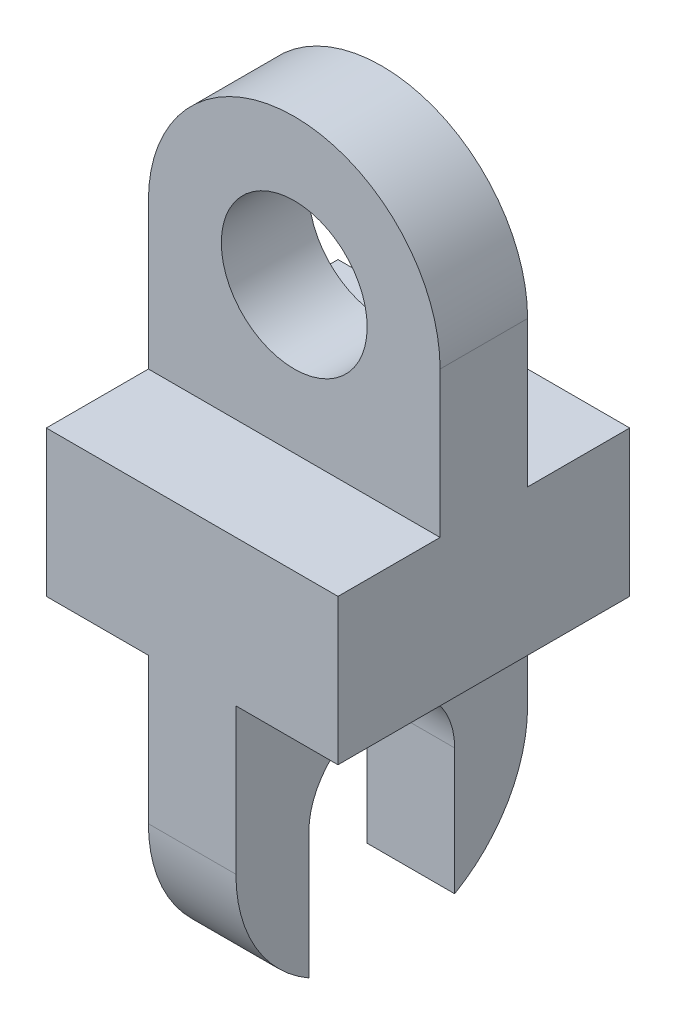
ISO-10303-21;
HEADER;
FILE_DESCRIPTION(('STEP AP214'),'2;1');
FILE_NAME('part.step','',(''),(''),'','','');
FILE_SCHEMA(('AUTOMOTIVE_DESIGN { 1 0 10303 214 1 1 1 1 }'));
ENDSEC;
DATA;
#1=APPLICATION_CONTEXT('core data for automotive mechanical design processes');
#2=APPLICATION_PROTOCOL_DEFINITION('international standard','automotive_design',2000,#1);
#3=PRODUCT_CONTEXT('',#1,'mechanical');
#4=PRODUCT('Part','Part','',(#3));
#5=PRODUCT_RELATED_PRODUCT_CATEGORY('part','',(#4));
#6=PRODUCT_DEFINITION_FORMATION('','',#4);
#7=PRODUCT_DEFINITION_CONTEXT('part definition',#1,'design');
#8=PRODUCT_DEFINITION('design','',#6,#7);
#9=PRODUCT_DEFINITION_SHAPE('','',#8);
#10=(LENGTH_UNIT() NAMED_UNIT(*) SI_UNIT(.MILLI.,.METRE.));
#11=(NAMED_UNIT(*) PLANE_ANGLE_UNIT() SI_UNIT($,.RADIAN.));
#12=(NAMED_UNIT(*) SI_UNIT($,.STERADIAN.) SOLID_ANGLE_UNIT());
#13=UNCERTAINTY_MEASURE_WITH_UNIT(LENGTH_MEASURE(1.E-05),#10,'distance_accuracy_value','');
#14=(GEOMETRIC_REPRESENTATION_CONTEXT(3) GLOBAL_UNCERTAINTY_ASSIGNED_CONTEXT((#13)) GLOBAL_UNIT_ASSIGNED_CONTEXT((#10,
#11,#12)) REPRESENTATION_CONTEXT('',''));
#15=CARTESIAN_POINT('',(0.,0.,0.));
#16=DIRECTION('',(0.,0.,1.));
#17=DIRECTION('',(1.,0.,0.));
#18=AXIS2_PLACEMENT_3D('',#15,#16,#17);
#19=CARTESIAN_POINT('',(50.,-50.,50.));
#20=DIRECTION('',(-1.,0.,0.));
#21=DIRECTION('',(0.,-1.,0.));
#22=AXIS2_PLACEMENT_3D('',#19,#20,#21);
#23=CYLINDRICAL_SURFACE('',#22,50.);
#24=DIRECTION('',(-1.,0.,0.));
#25=VECTOR('',#24,1.);
#26=CARTESIAN_POINT('',(50.,-93.301270189222,75.));
#27=LINE('',#26,#25);
#28=CARTESIAN_POINT('',(15.,-93.301270189222,75.));
#29=VERTEX_POINT('',#28);
#30=CARTESIAN_POINT('',(-15.,-93.301270189222,75.));
#31=VERTEX_POINT('',#30);
#32=EDGE_CURVE('E318',#29,#31,#27,.T.);
#33=ORIENTED_EDGE('',*,*,#32,.F.);
#34=CARTESIAN_POINT('',(15.,-50.,50.));
#35=DIRECTION('',(1.,0.,0.));
#36=DIRECTION('',(0.,1.,0.));
#37=AXIS2_PLACEMENT_3D('',#34,#35,#36);
#38=CIRCLE('',#37,50.);
#39=CARTESIAN_POINT('',(15.,-50.,100.));
#40=VERTEX_POINT('',#39);
#41=EDGE_CURVE('E294',#29,#40,#38,.F.);
#42=ORIENTED_EDGE('',*,*,#41,.T.);
#43=DIRECTION('',(-1.,0.,0.));
#44=VECTOR('',#43,1.);
#45=CARTESIAN_POINT('',(50.,-50.,100.));
#46=LINE('',#45,#44);
#47=CARTESIAN_POINT('',(-15.,-50.,100.));
#48=VERTEX_POINT('',#47);
#49=EDGE_CURVE('E191',#40,#48,#46,.T.);
#50=ORIENTED_EDGE('',*,*,#49,.T.);
#51=CARTESIAN_POINT('',(-15.,-50.,50.));
#52=DIRECTION('',(-1.,0.,0.));
#53=DIRECTION('',(0.,-1.,0.));
#54=AXIS2_PLACEMENT_3D('',#51,#52,#53);
#55=CIRCLE('',#54,50.);
#56=EDGE_CURVE('E181',#48,#31,#55,.F.);
#57=ORIENTED_EDGE('',*,*,#56,.T.);
#58=EDGE_LOOP('',(#33,#42,#50,#57));
#59=FACE_BOUND('',#58,.T.);
#60=ADVANCED_FACE('F45',(#59),#23,.T.);
#61=DIRECTION('',(-1.,0.,0.));
#62=VECTOR('',#61,1.);
#63=CARTESIAN_POINT('',(50.,-93.301270189222,25.));
#64=LINE('',#63,#62);
#65=CARTESIAN_POINT('',(-15.,-93.301270189222,25.));
#66=VERTEX_POINT('',#65);
#67=CARTESIAN_POINT('',(15.,-93.301270189222,25.));
#68=VERTEX_POINT('',#67);
#69=EDGE_CURVE('E61',#66,#68,#64,.F.);
#70=ORIENTED_EDGE('',*,*,#69,.F.);
#71=CARTESIAN_POINT('',(-15.,-50.,0.));
#72=VERTEX_POINT('',#71);
#73=EDGE_CURVE('E185',#66,#72,#55,.F.);
#74=ORIENTED_EDGE('',*,*,#73,.T.);
#75=DIRECTION('',(-1.,0.,0.));
#76=VECTOR('',#75,1.);
#77=CARTESIAN_POINT('',(50.,-50.,0.));
#78=LINE('',#77,#76);
#79=CARTESIAN_POINT('',(15.,-50.,0.));
#80=VERTEX_POINT('',#79);
#81=EDGE_CURVE('E265',#80,#72,#78,.T.);
#82=ORIENTED_EDGE('',*,*,#81,.F.);
#83=EDGE_CURVE('E68',#80,#68,#38,.F.);
#84=ORIENTED_EDGE('',*,*,#83,.T.);
#85=EDGE_LOOP('',(#70,#74,#82,#84));
#86=FACE_BOUND('',#85,.T.);
#87=ADVANCED_FACE('F334',(#86),#23,.T.);
#88=CARTESIAN_POINT('',(0.,100.,100.));
#89=DIRECTION('',(0.,0.,-1.));
#90=DIRECTION('',(-1.,0.,0.));
#91=AXIS2_PLACEMENT_3D('',#88,#89,#90);
#92=CYLINDRICAL_SURFACE('',#91,50.);
#93=CARTESIAN_POINT('',(0.,100.,35.));
#94=DIRECTION('',(0.,0.,-1.));
#95=DIRECTION('',(-1.,0.,0.));
#96=AXIS2_PLACEMENT_3D('',#93,#94,#95);
#97=CIRCLE('',#96,50.);
#98=CARTESIAN_POINT('',(-50.,100.,35.));
#99=VERTEX_POINT('',#98);
#100=CARTESIAN_POINT('',(50.,100.,35.));
#101=VERTEX_POINT('',#100);
#102=EDGE_CURVE('E257',#99,#101,#97,.T.);
#103=ORIENTED_EDGE('',*,*,#102,.F.);
#104=DIRECTION('',(0.,0.,-1.));
#105=VECTOR('',#104,1.);
#106=CARTESIAN_POINT('',(-50.,100.,100.));
#107=LINE('',#106,#105);
#108=CARTESIAN_POINT('',(-50.,100.,65.));
#109=VERTEX_POINT('',#108);
#110=EDGE_CURVE('E200',#109,#99,#107,.T.);
#111=ORIENTED_EDGE('',*,*,#110,.F.);
#112=CARTESIAN_POINT('',(0.,100.,65.));
#113=DIRECTION('',(0.,0.,1.));
#114=DIRECTION('',(1.,0.,0.));
#115=AXIS2_PLACEMENT_3D('',#112,#113,#114);
#116=CIRCLE('',#115,50.);
#117=CARTESIAN_POINT('',(50.,100.,65.));
#118=VERTEX_POINT('',#117);
#119=EDGE_CURVE('E232',#118,#109,#116,.T.);
#120=ORIENTED_EDGE('',*,*,#119,.F.);
#121=DIRECTION('',(0.,0.,-1.));
#122=VECTOR('',#121,1.);
#123=CARTESIAN_POINT('',(50.,100.,100.));
#124=LINE('',#123,#122);
#125=EDGE_CURVE('E196',#118,#101,#124,.T.);
#126=ORIENTED_EDGE('',*,*,#125,.T.);
#127=EDGE_LOOP('',(#103,#111,#120,#126));
#128=FACE_BOUND('',#127,.T.);
#129=ADVANCED_FACE('F368',(#128),#92,.T.);
#130=CARTESIAN_POINT('',(50.,100.,100.));
#131=DIRECTION('',(-1.,0.,0.));
#132=DIRECTION('',(0.,-1.,0.));
#133=AXIS2_PLACEMENT_3D('',#130,#131,#132);
#134=PLANE('',#133);
#135=DIRECTION('',(0.,1.,0.));
#136=VECTOR('',#135,1.);
#137=CARTESIAN_POINT('',(50.,100.,100.));
#138=LINE('',#137,#136);
#139=CARTESIAN_POINT('',(50.,0.,100.));
#140=VERTEX_POINT('',#139);
#141=CARTESIAN_POINT('',(50.,50.,100.));
#142=VERTEX_POINT('',#141);
#143=EDGE_CURVE('E209',#140,#142,#138,.T.);
#144=ORIENTED_EDGE('',*,*,#143,.F.);
#145=DIRECTION('',(0.,0.,1.));
#146=VECTOR('',#145,1.);
#147=CARTESIAN_POINT('',(50.,0.,100.));
#148=LINE('',#147,#146);
#149=CARTESIAN_POINT('',(50.,0.,0.));
#150=VERTEX_POINT('',#149);
#151=EDGE_CURVE('E303',#150,#140,#148,.T.);
#152=ORIENTED_EDGE('',*,*,#151,.F.);
#153=DIRECTION('',(0.,1.,0.));
#154=VECTOR('',#153,1.);
#155=CARTESIAN_POINT('',(50.,100.,0.));
#156=LINE('',#155,#154);
#157=CARTESIAN_POINT('',(50.,50.,0.));
#158=VERTEX_POINT('',#157);
#159=EDGE_CURVE('E210',#150,#158,#156,.T.);
#160=ORIENTED_EDGE('',*,*,#159,.T.);
#161=DIRECTION('',(0.,0.,-1.));
#162=VECTOR('',#161,1.);
#163=CARTESIAN_POINT('',(50.,50.,35.));
#164=LINE('',#163,#162);
#165=CARTESIAN_POINT('',(50.,50.,35.));
#166=VERTEX_POINT('',#165);
#167=EDGE_CURVE('E239',#166,#158,#164,.T.);
#168=ORIENTED_EDGE('',*,*,#167,.F.);
#169=DIRECTION('',(0.,-1.,0.));
#170=VECTOR('',#169,1.);
#171=CARTESIAN_POINT('',(50.,100.,35.));
#172=LINE('',#171,#170);
#173=EDGE_CURVE('E254',#101,#166,#172,.T.);
#174=ORIENTED_EDGE('',*,*,#173,.F.);
#175=ORIENTED_EDGE('',*,*,#125,.F.);
#176=DIRECTION('',(0.,1.,0.));
#177=VECTOR('',#176,1.);
#178=CARTESIAN_POINT('',(50.,100.,65.));
#179=LINE('',#178,#177);
#180=CARTESIAN_POINT('',(50.,50.,65.));
#181=VERTEX_POINT('',#180);
#182=EDGE_CURVE('E235',#181,#118,#179,.T.);
#183=ORIENTED_EDGE('',*,*,#182,.F.);
#184=DIRECTION('',(0.,0.,-1.));
#185=VECTOR('',#184,1.);
#186=CARTESIAN_POINT('',(50.,50.,100.000012));
#187=LINE('',#186,#185);
#188=EDGE_CURVE('E222',#142,#181,#187,.T.);
#189=ORIENTED_EDGE('',*,*,#188,.F.);
#190=EDGE_LOOP('',(#144,#152,#160,#168,#174,#175,#183,#189));
#191=FACE_BOUND('',#190,.T.);
#192=ADVANCED_FACE('F47',(#191),#134,.F.);
#193=CARTESIAN_POINT('',(-50.,100.,100.));
#194=DIRECTION('',(1.,0.,0.));
#195=DIRECTION('',(0.,1.,0.));
#196=AXIS2_PLACEMENT_3D('',#193,#194,#195);
#197=PLANE('',#196);
#198=DIRECTION('',(0.,-1.,0.));
#199=VECTOR('',#198,1.);
#200=CARTESIAN_POINT('',(-50.,100.,0.));
#201=LINE('',#200,#199);
#202=CARTESIAN_POINT('',(-50.,50.,0.));
#203=VERTEX_POINT('',#202);
#204=CARTESIAN_POINT('',(-50.,0.,0.));
#205=VERTEX_POINT('',#204);
#206=EDGE_CURVE('E205',#203,#205,#201,.T.);
#207=ORIENTED_EDGE('',*,*,#206,.T.);
#208=DIRECTION('',(0.,0.,-1.));
#209=VECTOR('',#208,1.);
#210=CARTESIAN_POINT('',(-50.,0.,0.));
#211=LINE('',#210,#209);
#212=CARTESIAN_POINT('',(-50.,0.,100.));
#213=VERTEX_POINT('',#212);
#214=EDGE_CURVE('E279',#213,#205,#211,.T.);
#215=ORIENTED_EDGE('',*,*,#214,.F.);
#216=DIRECTION('',(0.,-1.,0.));
#217=VECTOR('',#216,1.);
#218=CARTESIAN_POINT('',(-50.,100.,100.));
#219=LINE('',#218,#217);
#220=CARTESIAN_POINT('',(-50.,50.,100.));
#221=VERTEX_POINT('',#220);
#222=EDGE_CURVE('E204',#221,#213,#219,.T.);
#223=ORIENTED_EDGE('',*,*,#222,.F.);
#224=DIRECTION('',(0.,0.,-1.));
#225=VECTOR('',#224,1.);
#226=CARTESIAN_POINT('',(-50.,50.,100.000012));
#227=LINE('',#226,#225);
#228=CARTESIAN_POINT('',(-50.,50.,65.));
#229=VERTEX_POINT('',#228);
#230=EDGE_CURVE('E213',#221,#229,#227,.T.);
#231=ORIENTED_EDGE('',*,*,#230,.T.);
#232=DIRECTION('',(0.,-1.,0.));
#233=VECTOR('',#232,1.);
#234=CARTESIAN_POINT('',(-50.,100.,65.));
#235=LINE('',#234,#233);
#236=EDGE_CURVE('E229',#109,#229,#235,.T.);
#237=ORIENTED_EDGE('',*,*,#236,.F.);
#238=ORIENTED_EDGE('',*,*,#110,.T.);
#239=DIRECTION('',(0.,1.,0.));
#240=VECTOR('',#239,1.);
#241=CARTESIAN_POINT('',(-50.,100.,35.));
#242=LINE('',#241,#240);
#243=CARTESIAN_POINT('',(-50.,50.,35.));
#244=VERTEX_POINT('',#243);
#245=EDGE_CURVE('E250',#244,#99,#242,.T.);
#246=ORIENTED_EDGE('',*,*,#245,.F.);
#247=DIRECTION('',(0.,0.,-1.));
#248=VECTOR('',#247,1.);
#249=CARTESIAN_POINT('',(-50.,50.,35.));
#250=LINE('',#249,#248);
#251=EDGE_CURVE('E238',#244,#203,#250,.T.);
#252=ORIENTED_EDGE('',*,*,#251,.T.);
#253=EDGE_LOOP('',(#207,#215,#223,#231,#237,#238,#246,#252));
#254=FACE_BOUND('',#253,.T.);
#255=ADVANCED_FACE('F353',(#254),#197,.F.);
#256=CARTESIAN_POINT('',(0.,100.,100.));
#257=DIRECTION('',(0.,0.,1.));
#258=DIRECTION('',(1.,0.,0.));
#259=AXIS2_PLACEMENT_3D('',#256,#257,#258);
#260=PLANE('',#259);
#261=DIRECTION('',(1.,0.,0.));
#262=VECTOR('',#261,1.);
#263=CARTESIAN_POINT('',(15.,0.,100.));
#264=LINE('',#263,#262);
#265=CARTESIAN_POINT('',(15.,0.,100.));
#266=VERTEX_POINT('',#265);
#267=EDGE_CURVE('E298',#266,#140,#264,.T.);
#268=ORIENTED_EDGE('',*,*,#267,.T.);
#269=ORIENTED_EDGE('',*,*,#143,.T.);
#270=DIRECTION('',(-1.,0.,0.));
#271=VECTOR('',#270,1.);
#272=CARTESIAN_POINT('',(0.,50.,100.));
#273=LINE('',#272,#271);
#274=EDGE_CURVE('E192',#142,#221,#273,.T.);
#275=ORIENTED_EDGE('',*,*,#274,.T.);
#276=ORIENTED_EDGE('',*,*,#222,.T.);
#277=DIRECTION('',(-1.,0.,0.));
#278=VECTOR('',#277,1.);
#279=CARTESIAN_POINT('',(-15.,0.,100.));
#280=LINE('',#279,#278);
#281=CARTESIAN_POINT('',(-15.,0.,100.));
#282=VERTEX_POINT('',#281);
#283=EDGE_CURVE('E272',#282,#213,#280,.T.);
#284=ORIENTED_EDGE('',*,*,#283,.F.);
#285=DIRECTION('',(0.,1.,0.));
#286=VECTOR('',#285,1.);
#287=CARTESIAN_POINT('',(-15.,0.,100.));
#288=LINE('',#287,#286);
#289=EDGE_CURVE('E286',#48,#282,#288,.T.);
#290=ORIENTED_EDGE('',*,*,#289,.F.);
#291=ORIENTED_EDGE('',*,*,#49,.F.);
#292=DIRECTION('',(0.,-1.,0.));
#293=VECTOR('',#292,1.);
#294=CARTESIAN_POINT('',(15.,0.,100.));
#295=LINE('',#294,#293);
#296=EDGE_CURVE('E306',#266,#40,#295,.T.);
#297=ORIENTED_EDGE('',*,*,#296,.F.);
#298=EDGE_LOOP('',(#268,#269,#275,#276,#284,#290,#291,#297));
#299=FACE_BOUND('',#298,.T.);
#300=ADVANCED_FACE('F348',(#299),#260,.T.);
#301=CARTESIAN_POINT('',(0.,100.,0.));
#302=DIRECTION('',(0.,0.,1.));
#303=DIRECTION('',(1.,0.,0.));
#304=AXIS2_PLACEMENT_3D('',#301,#302,#303);
#305=PLANE('',#304);
#306=ORIENTED_EDGE('',*,*,#159,.F.);
#307=DIRECTION('',(1.,0.,0.));
#308=VECTOR('',#307,1.);
#309=CARTESIAN_POINT('',(15.,0.,0.));
#310=LINE('',#309,#308);
#311=CARTESIAN_POINT('',(15.,0.,0.));
#312=VERTEX_POINT('',#311);
#313=EDGE_CURVE('E295',#312,#150,#310,.T.);
#314=ORIENTED_EDGE('',*,*,#313,.F.);
#315=DIRECTION('',(0.,1.,0.));
#316=VECTOR('',#315,1.);
#317=CARTESIAN_POINT('',(15.,100.,0.));
#318=LINE('',#317,#316);
#319=EDGE_CURVE('E163',#80,#312,#318,.T.);
#320=ORIENTED_EDGE('',*,*,#319,.F.);
#321=ORIENTED_EDGE('',*,*,#81,.T.);
#322=DIRECTION('',(0.,-1.,0.));
#323=VECTOR('',#322,1.);
#324=CARTESIAN_POINT('',(-15.,0.,0.));
#325=LINE('',#324,#323);
#326=CARTESIAN_POINT('',(-15.,0.,0.));
#327=VERTEX_POINT('',#326);
#328=EDGE_CURVE('E282',#327,#72,#325,.T.);
#329=ORIENTED_EDGE('',*,*,#328,.F.);
#330=DIRECTION('',(-1.,0.,0.));
#331=VECTOR('',#330,1.);
#332=CARTESIAN_POINT('',(-15.,0.,0.));
#333=LINE('',#332,#331);
#334=EDGE_CURVE('E269',#327,#205,#333,.T.);
#335=ORIENTED_EDGE('',*,*,#334,.T.);
#336=ORIENTED_EDGE('',*,*,#206,.F.);
#337=DIRECTION('',(-1.,0.,0.));
#338=VECTOR('',#337,1.);
#339=CARTESIAN_POINT('',(50.,50.,0.));
#340=LINE('',#339,#338);
#341=EDGE_CURVE('E247',#158,#203,#340,.T.);
#342=ORIENTED_EDGE('',*,*,#341,.F.);
#343=EDGE_LOOP('',(#306,#314,#320,#321,#329,#335,#336,#342));
#344=FACE_BOUND('',#343,.T.);
#345=ADVANCED_FACE('F339',(#344),#305,.F.);
#346=CARTESIAN_POINT('',(-50.,50.,100.000012));
#347=DIRECTION('',(0.,1.,0.));
#348=DIRECTION('',(0.,0.,1.));
#349=AXIS2_PLACEMENT_3D('',#346,#347,#348);
#350=PLANE('',#349);
#351=ORIENTED_EDGE('',*,*,#188,.T.);
#352=DIRECTION('',(1.,0.,0.));
#353=VECTOR('',#352,1.);
#354=CARTESIAN_POINT('',(-50.,50.,65.));
#355=LINE('',#354,#353);
#356=EDGE_CURVE('E225',#229,#181,#355,.T.);
#357=ORIENTED_EDGE('',*,*,#356,.F.);
#358=ORIENTED_EDGE('',*,*,#230,.F.);
#359=ORIENTED_EDGE('',*,*,#274,.F.);
#360=EDGE_LOOP('',(#351,#357,#358,#359));
#361=FACE_BOUND('',#360,.T.);
#362=ADVANCED_FACE('F414',(#361),#350,.T.);
#363=CARTESIAN_POINT('',(0.,100.,65.));
#364=DIRECTION('',(0.,0.,1.));
#365=DIRECTION('',(1.,0.,0.));
#366=AXIS2_PLACEMENT_3D('',#363,#364,#365);
#367=PLANE('',#366);
#368=CARTESIAN_POINT('',(0.,100.,65.));
#369=DIRECTION('',(0.,0.,1.));
#370=DIRECTION('',(1.,0.,0.));
#371=AXIS2_PLACEMENT_3D('',#368,#369,#370);
#372=CIRCLE('',#371,25.);
#373=CARTESIAN_POINT('',(25.,100.,65.));
#374=VERTEX_POINT('',#373);
#375=EDGE_CURVE('E190',#374,#374,#372,.T.);
#376=ORIENTED_EDGE('',*,*,#375,.F.);
#377=EDGE_LOOP('',(#376));
#378=FACE_BOUND('',#377,.T.);
#379=ORIENTED_EDGE('',*,*,#182,.T.);
#380=ORIENTED_EDGE('',*,*,#119,.T.);
#381=ORIENTED_EDGE('',*,*,#236,.T.);
#382=ORIENTED_EDGE('',*,*,#356,.T.);
#383=EDGE_LOOP('',(#379,#380,#381,#382));
#384=FACE_BOUND('',#383,.T.);
#385=ADVANCED_FACE('F411',(#378,#384),#367,.T.);
#386=CARTESIAN_POINT('',(50.,50.,35.));
#387=DIRECTION('',(0.,-1.,0.));
#388=DIRECTION('',(0.,0.,-1.));
#389=AXIS2_PLACEMENT_3D('',#386,#387,#388);
#390=PLANE('',#389);
#391=ORIENTED_EDGE('',*,*,#341,.T.);
#392=ORIENTED_EDGE('',*,*,#251,.F.);
#393=DIRECTION('',(-1.,0.,0.));
#394=VECTOR('',#393,1.);
#395=CARTESIAN_POINT('',(50.,50.,35.));
#396=LINE('',#395,#394);
#397=EDGE_CURVE('E243',#166,#244,#396,.T.);
#398=ORIENTED_EDGE('',*,*,#397,.F.);
#399=ORIENTED_EDGE('',*,*,#167,.T.);
#400=EDGE_LOOP('',(#391,#392,#398,#399));
#401=FACE_BOUND('',#400,.T.);
#402=ADVANCED_FACE('F358',(#401),#390,.F.);
#403=CARTESIAN_POINT('',(0.,100.,35.));
#404=DIRECTION('',(0.,0.,-1.));
#405=DIRECTION('',(-1.,0.,0.));
#406=AXIS2_PLACEMENT_3D('',#403,#404,#405);
#407=PLANE('',#406);
#408=CARTESIAN_POINT('',(0.,100.,35.));
#409=DIRECTION('',(0.,0.,-1.));
#410=DIRECTION('',(-1.,0.,0.));
#411=AXIS2_PLACEMENT_3D('',#408,#409,#410);
#412=CIRCLE('',#411,25.);
#413=CARTESIAN_POINT('',(-25.,100.,35.));
#414=VERTEX_POINT('',#413);
#415=EDGE_CURVE('E186',#414,#414,#412,.T.);
#416=ORIENTED_EDGE('',*,*,#415,.F.);
#417=EDGE_LOOP('',(#416));
#418=FACE_BOUND('',#417,.T.);
#419=ORIENTED_EDGE('',*,*,#245,.T.);
#420=ORIENTED_EDGE('',*,*,#102,.T.);
#421=ORIENTED_EDGE('',*,*,#173,.T.);
#422=ORIENTED_EDGE('',*,*,#397,.T.);
#423=EDGE_LOOP('',(#419,#420,#421,#422));
#424=FACE_BOUND('',#423,.T.);
#425=ADVANCED_FACE('F365',(#418,#424),#407,.T.);
#426=CARTESIAN_POINT('',(0.,100.,100.));
#427=DIRECTION('',(0.,0.,-1.));
#428=DIRECTION('',(-1.,0.,0.));
#429=AXIS2_PLACEMENT_3D('',#426,#427,#428);
#430=CYLINDRICAL_SURFACE('',#429,25.);
#431=ORIENTED_EDGE('',*,*,#375,.T.);
#432=EDGE_LOOP('',(#431));
#433=FACE_BOUND('',#432,.T.);
#434=ORIENTED_EDGE('',*,*,#415,.T.);
#435=EDGE_LOOP('',(#434));
#436=FACE_BOUND('',#435,.T.);
#437=ADVANCED_FACE('F402',(#433,#436),#430,.F.);
#438=CARTESIAN_POINT('',(-15.,0.,0.));
#439=DIRECTION('',(0.,1.,0.));
#440=DIRECTION('',(-1.,0.,0.));
#441=AXIS2_PLACEMENT_3D('',#438,#439,#440);
#442=PLANE('',#441);
#443=ORIENTED_EDGE('',*,*,#214,.T.);
#444=ORIENTED_EDGE('',*,*,#334,.F.);
#445=DIRECTION('',(0.,0.,-1.));
#446=VECTOR('',#445,1.);
#447=CARTESIAN_POINT('',(-15.,0.,0.));
#448=LINE('',#447,#446);
#449=EDGE_CURVE('E275',#282,#327,#448,.T.);
#450=ORIENTED_EDGE('',*,*,#449,.F.);
#451=ORIENTED_EDGE('',*,*,#283,.T.);
#452=EDGE_LOOP('',(#443,#444,#450,#451));
#453=FACE_BOUND('',#452,.T.);
#454=ADVANCED_FACE('F345',(#453),#442,.F.);
#455=CARTESIAN_POINT('',(-15.,0.,0.));
#456=DIRECTION('',(-1.,0.,0.));
#457=DIRECTION('',(0.,-1.,0.));
#458=AXIS2_PLACEMENT_3D('',#455,#456,#457);
#459=PLANE('',#458);
#460=DIRECTION('',(0.,1.,0.));
#461=VECTOR('',#460,1.);
#462=CARTESIAN_POINT('',(-15.,0.,75.));
#463=LINE('',#462,#461);
#464=CARTESIAN_POINT('',(-15.,-50.,75.));
#465=VERTEX_POINT('',#464);
#466=EDGE_CURVE('E315',#31,#465,#463,.T.);
#467=ORIENTED_EDGE('',*,*,#466,.F.);
#468=ORIENTED_EDGE('',*,*,#56,.F.);
#469=ORIENTED_EDGE('',*,*,#289,.T.);
#470=ORIENTED_EDGE('',*,*,#449,.T.);
#471=ORIENTED_EDGE('',*,*,#328,.T.);
#472=ORIENTED_EDGE('',*,*,#73,.F.);
#473=DIRECTION('',(0.,-1.,0.));
#474=VECTOR('',#473,1.);
#475=CARTESIAN_POINT('',(-15.,0.,25.));
#476=LINE('',#475,#474);
#477=CARTESIAN_POINT('',(-15.,-50.,25.));
#478=VERTEX_POINT('',#477);
#479=EDGE_CURVE('E321',#478,#66,#476,.T.);
#480=ORIENTED_EDGE('',*,*,#479,.F.);
#481=CARTESIAN_POINT('',(-15.,-50.,50.));
#482=DIRECTION('',(-1.,0.,0.));
#483=DIRECTION('',(0.,-1.,0.));
#484=AXIS2_PLACEMENT_3D('',#481,#482,#483);
#485=CIRCLE('',#484,25.);
#486=EDGE_CURVE('E170',#465,#478,#485,.T.);
#487=ORIENTED_EDGE('',*,*,#486,.F.);
#488=EDGE_LOOP('',(#467,#468,#469,#470,#471,#472,#480,#487));
#489=FACE_BOUND('',#488,.T.);
#490=ADVANCED_FACE('F330',(#489),#459,.T.);
#491=CARTESIAN_POINT('',(15.,0.,100.));
#492=DIRECTION('',(0.,1.,0.));
#493=DIRECTION('',(-1.,0.,0.));
#494=AXIS2_PLACEMENT_3D('',#491,#492,#493);
#495=PLANE('',#494);
#496=ORIENTED_EDGE('',*,*,#151,.T.);
#497=ORIENTED_EDGE('',*,*,#267,.F.);
#498=DIRECTION('',(0.,0.,1.));
#499=VECTOR('',#498,1.);
#500=CARTESIAN_POINT('',(15.,0.,100.));
#501=LINE('',#500,#499);
#502=EDGE_CURVE('E299',#312,#266,#501,.T.);
#503=ORIENTED_EDGE('',*,*,#502,.F.);
#504=ORIENTED_EDGE('',*,*,#313,.T.);
#505=EDGE_LOOP('',(#496,#497,#503,#504));
#506=FACE_BOUND('',#505,.T.);
#507=ADVANCED_FACE('F377',(#506),#495,.F.);
#508=CARTESIAN_POINT('',(15.,0.,0.));
#509=DIRECTION('',(1.,0.,0.));
#510=DIRECTION('',(0.,1.,0.));
#511=AXIS2_PLACEMENT_3D('',#508,#509,#510);
#512=PLANE('',#511);
#513=DIRECTION('',(0.,-1.,0.));
#514=VECTOR('',#513,1.);
#515=CARTESIAN_POINT('',(15.,0.,75.));
#516=LINE('',#515,#514);
#517=CARTESIAN_POINT('',(15.,-50.,75.));
#518=VERTEX_POINT('',#517);
#519=EDGE_CURVE('E11',#518,#29,#516,.T.);
#520=ORIENTED_EDGE('',*,*,#519,.F.);
#521=CARTESIAN_POINT('',(15.,-50.,50.));
#522=DIRECTION('',(1.,0.,0.));
#523=DIRECTION('',(0.,1.,0.));
#524=AXIS2_PLACEMENT_3D('',#521,#522,#523);
#525=CIRCLE('',#524,25.);
#526=CARTESIAN_POINT('',(15.,-50.,25.));
#527=VERTEX_POINT('',#526);
#528=EDGE_CURVE('E54',#527,#518,#525,.T.);
#529=ORIENTED_EDGE('',*,*,#528,.F.);
#530=DIRECTION('',(0.,1.,0.));
#531=VECTOR('',#530,1.);
#532=CARTESIAN_POINT('',(15.,0.,25.));
#533=LINE('',#532,#531);
#534=EDGE_CURVE('E156',#68,#527,#533,.T.);
#535=ORIENTED_EDGE('',*,*,#534,.F.);
#536=ORIENTED_EDGE('',*,*,#83,.F.);
#537=ORIENTED_EDGE('',*,*,#319,.T.);
#538=ORIENTED_EDGE('',*,*,#502,.T.);
#539=ORIENTED_EDGE('',*,*,#296,.T.);
#540=ORIENTED_EDGE('',*,*,#41,.F.);
#541=EDGE_LOOP('',(#520,#529,#535,#536,#537,#538,#539,#540));
#542=FACE_BOUND('',#541,.T.);
#543=ADVANCED_FACE('F175',(#542),#512,.T.);
#544=CARTESIAN_POINT('',(50.,-50.,50.));
#545=DIRECTION('',(-1.,0.,0.));
#546=DIRECTION('',(0.,-1.,0.));
#547=AXIS2_PLACEMENT_3D('',#544,#545,#546);
#548=CYLINDRICAL_SURFACE('',#547,25.);
#549=ORIENTED_EDGE('',*,*,#486,.T.);
#550=DIRECTION('',(-1.,0.,0.));
#551=VECTOR('',#550,1.);
#552=CARTESIAN_POINT('',(50.,-50.,25.));
#553=LINE('',#552,#551);
#554=EDGE_CURVE('E159',#527,#478,#553,.T.);
#555=ORIENTED_EDGE('',*,*,#554,.F.);
#556=ORIENTED_EDGE('',*,*,#528,.T.);
#557=DIRECTION('',(-1.,0.,0.));
#558=VECTOR('',#557,1.);
#559=CARTESIAN_POINT('',(50.,-50.,75.));
#560=LINE('',#559,#558);
#561=EDGE_CURVE('E172',#518,#465,#560,.T.);
#562=ORIENTED_EDGE('',*,*,#561,.T.);
#563=EDGE_LOOP('',(#549,#555,#556,#562));
#564=FACE_BOUND('',#563,.T.);
#565=ADVANCED_FACE('F166',(#564),#548,.F.);
#566=CARTESIAN_POINT('',(50.,-50.,75.));
#567=DIRECTION('',(0.,0.,1.));
#568=DIRECTION('',(1.,0.,0.));
#569=AXIS2_PLACEMENT_3D('',#566,#567,#568);
#570=PLANE('',#569);
#571=ORIENTED_EDGE('',*,*,#466,.T.);
#572=ORIENTED_EDGE('',*,*,#561,.F.);
#573=ORIENTED_EDGE('',*,*,#519,.T.);
#574=ORIENTED_EDGE('',*,*,#32,.T.);
#575=EDGE_LOOP('',(#571,#572,#573,#574));
#576=FACE_BOUND('',#575,.T.);
#577=ADVANCED_FACE('F384',(#576),#570,.F.);
#578=CARTESIAN_POINT('',(50.,-50.,25.));
#579=DIRECTION('',(0.,0.,-1.));
#580=DIRECTION('',(-1.,0.,0.));
#581=AXIS2_PLACEMENT_3D('',#578,#579,#580);
#582=PLANE('',#581);
#583=ORIENTED_EDGE('',*,*,#479,.T.);
#584=ORIENTED_EDGE('',*,*,#69,.T.);
#585=ORIENTED_EDGE('',*,*,#534,.T.);
#586=ORIENTED_EDGE('',*,*,#554,.T.);
#587=EDGE_LOOP('',(#583,#584,#585,#586));
#588=FACE_BOUND('',#587,.T.);
#589=ADVANCED_FACE('F158',(#588),#582,.F.);
#590=CLOSED_SHELL('',(#60,#87,#129,#192,#255,#300,#345,#362,#385,#402,#425,#437,#454,#490,#507,
#543,#565,#577,#589));
#591=MANIFOLD_SOLID_BREP('B2',#590);
#592=ADVANCED_BREP_SHAPE_REPRESENTATION('',(#18,#591),#14);
#593=SHAPE_DEFINITION_REPRESENTATION(#9,#592);
ENDSEC;
END-ISO-10303-21;
